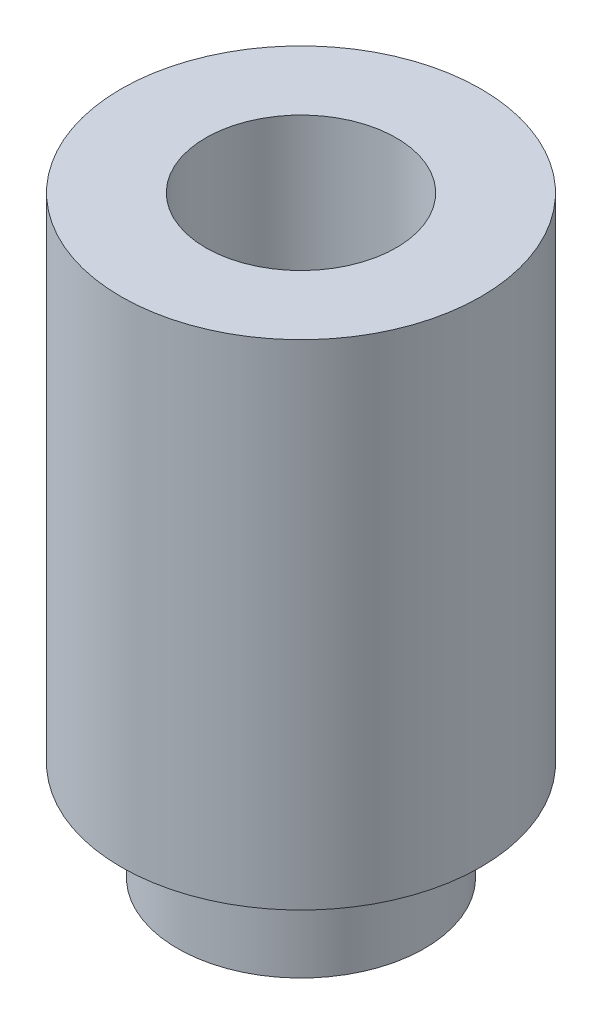
ISO-10303-21;
HEADER;
FILE_DESCRIPTION(('STEP AP214'),'2;1');
FILE_NAME('part.step','',(''),(''),'','','');
FILE_SCHEMA(('AUTOMOTIVE_DESIGN { 1 0 10303 214 1 1 1 1 }'));
ENDSEC;
DATA;
#1=APPLICATION_CONTEXT('core data for automotive mechanical design processes');
#2=APPLICATION_PROTOCOL_DEFINITION('international standard','automotive_design',2000,#1);
#3=PRODUCT_CONTEXT('',#1,'mechanical');
#4=PRODUCT('Part','Part','',(#3));
#5=PRODUCT_RELATED_PRODUCT_CATEGORY('part','',(#4));
#6=PRODUCT_DEFINITION_FORMATION('','',#4);
#7=PRODUCT_DEFINITION_CONTEXT('part definition',#1,'design');
#8=PRODUCT_DEFINITION('design','',#6,#7);
#9=PRODUCT_DEFINITION_SHAPE('','',#8);
#10=(LENGTH_UNIT() NAMED_UNIT(*) SI_UNIT(.MILLI.,.METRE.));
#11=(NAMED_UNIT(*) PLANE_ANGLE_UNIT() SI_UNIT($,.RADIAN.));
#12=(NAMED_UNIT(*) SI_UNIT($,.STERADIAN.) SOLID_ANGLE_UNIT());
#13=UNCERTAINTY_MEASURE_WITH_UNIT(LENGTH_MEASURE(1.E-05),#10,'distance_accuracy_value','');
#14=(GEOMETRIC_REPRESENTATION_CONTEXT(3) GLOBAL_UNCERTAINTY_ASSIGNED_CONTEXT((#13)) GLOBAL_UNIT_ASSIGNED_CONTEXT((#10,
#11,#12)) REPRESENTATION_CONTEXT('',''));
#15=CARTESIAN_POINT('',(0.,0.,0.));
#16=DIRECTION('',(0.,0.,1.));
#17=DIRECTION('',(1.,0.,0.));
#18=AXIS2_PLACEMENT_3D('',#15,#16,#17);
#19=CARTESIAN_POINT('',(3.4,0.8,-3.4));
#20=DIRECTION('',(0.,-1.,0.));
#21=DIRECTION('',(0.,0.,-1.));
#22=AXIS2_PLACEMENT_3D('',#19,#20,#21);
#23=CYLINDRICAL_SURFACE('',#22,1.75);
#24=CARTESIAN_POINT('',(3.4,-0.6,-3.4));
#25=DIRECTION('',(0.,-1.,0.));
#26=DIRECTION('',(0.,0.,-1.));
#27=AXIS2_PLACEMENT_3D('',#24,#25,#26);
#28=CIRCLE('',#27,1.75);
#29=CARTESIAN_POINT('',(3.4,-0.6,-5.15));
#30=VERTEX_POINT('',#29);
#31=EDGE_CURVE('E35',#30,#30,#28,.T.);
#32=ORIENTED_EDGE('',*,*,#31,.F.);
#33=EDGE_LOOP('',(#32));
#34=FACE_BOUND('',#33,.T.);
#35=CARTESIAN_POINT('',(3.4,0.8,-3.4));
#36=DIRECTION('',(0.,-1.,0.));
#37=DIRECTION('',(0.,0.,-1.));
#38=AXIS2_PLACEMENT_3D('',#35,#36,#37);
#39=CIRCLE('',#38,1.75);
#40=CARTESIAN_POINT('',(3.4,0.8,-5.15));
#41=VERTEX_POINT('',#40);
#42=EDGE_CURVE('E19',#41,#41,#39,.F.);
#43=ORIENTED_EDGE('',*,*,#42,.F.);
#44=EDGE_LOOP('',(#43));
#45=FACE_BOUND('',#44,.T.);
#46=ADVANCED_FACE('F15',(#34,#45),#23,.T.);
#47=CARTESIAN_POINT('',(0.799,0.8,-6.00563344399579));
#48=DIRECTION('',(0.,-1.,0.));
#49=DIRECTION('',(1.,0.,0.));
#50=AXIS2_PLACEMENT_3D('',#47,#48,#49);
#51=PLANE('',#50);
#52=ORIENTED_EDGE('',*,*,#42,.T.);
#53=EDGE_LOOP('',(#52));
#54=FACE_BOUND('',#53,.T.);
#55=CARTESIAN_POINT('',(3.4,0.8,-3.4));
#56=DIRECTION('',(0.,-1.,0.));
#57=DIRECTION('',(0.,0.,-1.));
#58=AXIS2_PLACEMENT_3D('',#55,#56,#57);
#59=CIRCLE('',#58,2.55);
#60=CARTESIAN_POINT('',(3.4,0.8,-5.95));
#61=VERTEX_POINT('',#60);
#62=EDGE_CURVE('E33',#61,#61,#59,.T.);
#63=ORIENTED_EDGE('',*,*,#62,.T.);
#64=EDGE_LOOP('',(#63));
#65=FACE_BOUND('',#64,.T.);
#66=ADVANCED_FACE('F42',(#54,#65),#51,.T.);
#67=CARTESIAN_POINT('',(1.615,-0.6,-5.195576627153));
#68=DIRECTION('',(0.,-1.,0.));
#69=DIRECTION('',(1.,0.,0.));
#70=AXIS2_PLACEMENT_3D('',#67,#68,#69);
#71=PLANE('',#70);
#72=CARTESIAN_POINT('',(3.4,-0.6,-3.4));
#73=DIRECTION('',(0.,1.,0.));
#74=DIRECTION('',(0.,0.,1.));
#75=AXIS2_PLACEMENT_3D('',#72,#73,#74);
#76=CIRCLE('',#75,1.35);
#77=CARTESIAN_POINT('',(3.4,-0.6,-2.05));
#78=VERTEX_POINT('',#77);
#79=EDGE_CURVE('E28',#78,#78,#76,.F.);
#80=ORIENTED_EDGE('',*,*,#79,.F.);
#81=EDGE_LOOP('',(#80));
#82=FACE_BOUND('',#81,.T.);
#83=ORIENTED_EDGE('',*,*,#31,.T.);
#84=EDGE_LOOP('',(#83));
#85=FACE_BOUND('',#84,.T.);
#86=ADVANCED_FACE('F52',(#82,#85),#71,.T.);
#87=CARTESIAN_POINT('',(3.4,7.8,-3.4));
#88=DIRECTION('',(0.,-1.,0.));
#89=DIRECTION('',(0.,0.,-1.));
#90=AXIS2_PLACEMENT_3D('',#87,#88,#89);
#91=CYLINDRICAL_SURFACE('',#90,2.55);
#92=ORIENTED_EDGE('',*,*,#62,.F.);
#93=EDGE_LOOP('',(#92));
#94=FACE_BOUND('',#93,.T.);
#95=CARTESIAN_POINT('',(3.4,7.8,-3.4));
#96=DIRECTION('',(0.,-1.,0.));
#97=DIRECTION('',(0.,0.,-1.));
#98=AXIS2_PLACEMENT_3D('',#95,#96,#97);
#99=CIRCLE('',#98,2.55);
#100=CARTESIAN_POINT('',(3.4,7.8,-5.95));
#101=VERTEX_POINT('',#100);
#102=EDGE_CURVE('E23',#101,#101,#99,.T.);
#103=ORIENTED_EDGE('',*,*,#102,.T.);
#104=EDGE_LOOP('',(#103));
#105=FACE_BOUND('',#104,.T.);
#106=ADVANCED_FACE('F61',(#94,#105),#91,.T.);
#107=CARTESIAN_POINT('',(3.4,-0.6,-3.4));
#108=DIRECTION('',(0.,1.,0.));
#109=DIRECTION('',(0.,0.,1.));
#110=AXIS2_PLACEMENT_3D('',#107,#108,#109);
#111=CYLINDRICAL_SURFACE('',#110,1.35);
#112=ORIENTED_EDGE('',*,*,#79,.T.);
#113=EDGE_LOOP('',(#112));
#114=FACE_BOUND('',#113,.T.);
#115=CARTESIAN_POINT('',(3.4,7.8,-3.4));
#116=DIRECTION('',(0.,1.,0.));
#117=DIRECTION('',(0.,0.,1.));
#118=AXIS2_PLACEMENT_3D('',#115,#116,#117);
#119=CIRCLE('',#118,1.35);
#120=CARTESIAN_POINT('',(3.4,7.8,-2.05));
#121=VERTEX_POINT('',#120);
#122=EDGE_CURVE('E10',#121,#121,#119,.T.);
#123=ORIENTED_EDGE('',*,*,#122,.T.);
#124=EDGE_LOOP('',(#123));
#125=FACE_BOUND('',#124,.T.);
#126=ADVANCED_FACE('F56',(#114,#125),#111,.F.);
#127=CARTESIAN_POINT('',(0.799,7.8,-6.00563344399579));
#128=DIRECTION('',(0.,-1.,0.));
#129=DIRECTION('',(1.,0.,0.));
#130=AXIS2_PLACEMENT_3D('',#127,#128,#129);
#131=PLANE('',#130);
#132=ORIENTED_EDGE('',*,*,#122,.F.);
#133=EDGE_LOOP('',(#132));
#134=FACE_BOUND('',#133,.T.);
#135=ORIENTED_EDGE('',*,*,#102,.F.);
#136=EDGE_LOOP('',(#135));
#137=FACE_BOUND('',#136,.T.);
#138=ADVANCED_FACE('F17',(#134,#137),#131,.F.);
#139=CLOSED_SHELL('',(#46,#66,#86,#106,#126,#138));
#140=MANIFOLD_SOLID_BREP('B1',#139);
#141=ADVANCED_BREP_SHAPE_REPRESENTATION('',(#18,#140),#14);
#142=SHAPE_DEFINITION_REPRESENTATION(#9,#141);
ENDSEC;
END-ISO-10303-21;
